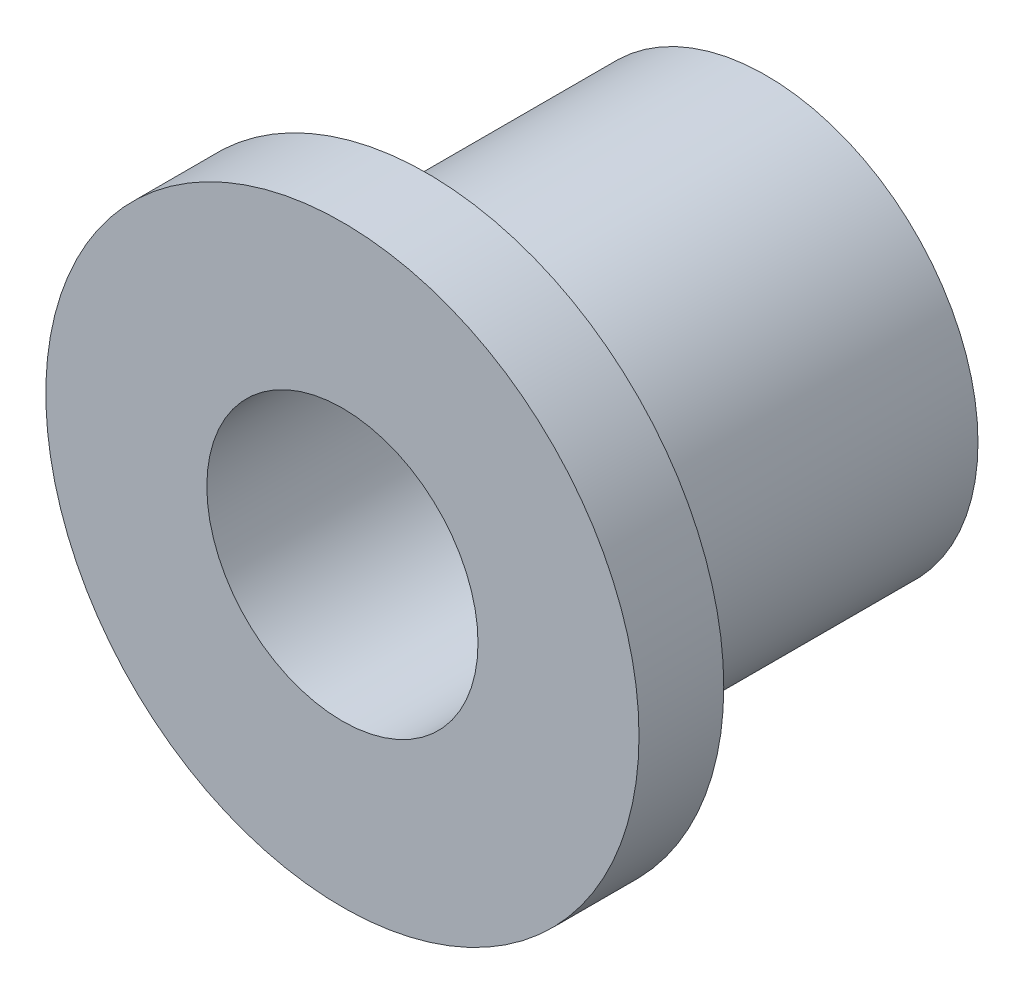
ISO-10303-21;
HEADER;
FILE_DESCRIPTION(('STEP AP214'),'2;1');
FILE_NAME('part.step','',(''),(''),'','','');
FILE_SCHEMA(('AUTOMOTIVE_DESIGN { 1 0 10303 214 1 1 1 1 }'));
ENDSEC;
DATA;
#1=APPLICATION_CONTEXT('core data for automotive mechanical design processes');
#2=APPLICATION_PROTOCOL_DEFINITION('international standard','automotive_design',2000,#1);
#3=PRODUCT_CONTEXT('',#1,'mechanical');
#4=PRODUCT('Part','Part','',(#3));
#5=PRODUCT_RELATED_PRODUCT_CATEGORY('part','',(#4));
#6=PRODUCT_DEFINITION_FORMATION('','',#4);
#7=PRODUCT_DEFINITION_CONTEXT('part definition',#1,'design');
#8=PRODUCT_DEFINITION('design','',#6,#7);
#9=PRODUCT_DEFINITION_SHAPE('','',#8);
#10=(LENGTH_UNIT() NAMED_UNIT(*) SI_UNIT(.MILLI.,.METRE.));
#11=(NAMED_UNIT(*) PLANE_ANGLE_UNIT() SI_UNIT($,.RADIAN.));
#12=(NAMED_UNIT(*) SI_UNIT($,.STERADIAN.) SOLID_ANGLE_UNIT());
#13=UNCERTAINTY_MEASURE_WITH_UNIT(LENGTH_MEASURE(1.E-05),#10,'distance_accuracy_value','');
#14=(GEOMETRIC_REPRESENTATION_CONTEXT(3) GLOBAL_UNCERTAINTY_ASSIGNED_CONTEXT((#13)) GLOBAL_UNIT_ASSIGNED_CONTEXT((#10,
#11,#12)) REPRESENTATION_CONTEXT('',''));
#15=CARTESIAN_POINT('',(0.,0.,0.));
#16=DIRECTION('',(0.,0.,1.));
#17=DIRECTION('',(1.,0.,0.));
#18=AXIS2_PLACEMENT_3D('',#15,#16,#17);
#19=CARTESIAN_POINT('',(0.,0.,0.));
#20=DIRECTION('',(0.,0.,1.));
#21=DIRECTION('',(1.,0.,0.));
#22=AXIS2_PLACEMENT_3D('',#19,#20,#21);
#23=PLANE('',#22);
#24=CARTESIAN_POINT('',(0.,0.,0.));
#25=DIRECTION('',(0.,0.,1.));
#26=DIRECTION('',(1.,0.,0.));
#27=AXIS2_PLACEMENT_3D('',#24,#25,#26);
#28=CIRCLE('',#27,2.5);
#29=CARTESIAN_POINT('',(2.5,0.,0.));
#30=VERTEX_POINT('',#29);
#31=EDGE_CURVE('E41',#30,#30,#28,.T.);
#32=ORIENTED_EDGE('',*,*,#31,.F.);
#33=EDGE_LOOP('',(#32));
#34=FACE_BOUND('',#33,.T.);
#35=CARTESIAN_POINT('',(0.,0.,0.));
#36=DIRECTION('',(0.,0.,1.));
#37=DIRECTION('',(1.,0.,0.));
#38=AXIS2_PLACEMENT_3D('',#35,#36,#37);
#39=CIRCLE('',#38,1.6);
#40=CARTESIAN_POINT('',(1.6,0.,0.));
#41=VERTEX_POINT('',#40);
#42=EDGE_CURVE('E50',#41,#41,#39,.T.);
#43=ORIENTED_EDGE('',*,*,#42,.T.);
#44=EDGE_LOOP('',(#43));
#45=FACE_BOUND('',#44,.T.);
#46=ADVANCED_FACE('F37',(#34,#45),#23,.F.);
#47=CARTESIAN_POINT('',(0.,0.,4.));
#48=DIRECTION('',(0.,0.,-1.));
#49=DIRECTION('',(-1.,0.,0.));
#50=AXIS2_PLACEMENT_3D('',#47,#48,#49);
#51=CYLINDRICAL_SURFACE('',#50,2.5);
#52=CARTESIAN_POINT('',(0.,0.,4.));
#53=DIRECTION('',(0.,0.,1.));
#54=DIRECTION('',(1.,0.,0.));
#55=AXIS2_PLACEMENT_3D('',#52,#53,#54);
#56=CIRCLE('',#55,2.5);
#57=CARTESIAN_POINT('',(2.5,0.,4.));
#58=VERTEX_POINT('',#57);
#59=EDGE_CURVE('E10',#58,#58,#56,.T.);
#60=ORIENTED_EDGE('',*,*,#59,.F.);
#61=EDGE_LOOP('',(#60));
#62=FACE_BOUND('',#61,.T.);
#63=ORIENTED_EDGE('',*,*,#31,.T.);
#64=EDGE_LOOP('',(#63));
#65=FACE_BOUND('',#64,.T.);
#66=ADVANCED_FACE('F39',(#62,#65),#51,.T.);
#67=CARTESIAN_POINT('',(0.,0.,4.));
#68=DIRECTION('',(0.,0.,-1.));
#69=DIRECTION('',(-1.,0.,0.));
#70=AXIS2_PLACEMENT_3D('',#67,#68,#69);
#71=CYLINDRICAL_SURFACE('',#70,1.6);
#72=ORIENTED_EDGE('',*,*,#42,.F.);
#73=EDGE_LOOP('',(#72));
#74=FACE_BOUND('',#73,.T.);
#75=CARTESIAN_POINT('',(0.,0.,5.));
#76=DIRECTION('',(0.,0.,1.));
#77=DIRECTION('',(1.,0.,0.));
#78=AXIS2_PLACEMENT_3D('',#75,#76,#77);
#79=CIRCLE('',#78,1.6);
#80=CARTESIAN_POINT('',(1.6,0.,5.));
#81=VERTEX_POINT('',#80);
#82=EDGE_CURVE('E60',#81,#81,#79,.T.);
#83=ORIENTED_EDGE('',*,*,#82,.T.);
#84=EDGE_LOOP('',(#83));
#85=FACE_BOUND('',#84,.T.);
#86=ADVANCED_FACE('F68',(#74,#85),#71,.F.);
#87=CARTESIAN_POINT('',(0.,0.,5.));
#88=DIRECTION('',(0.,0.,1.));
#89=DIRECTION('',(1.,0.,0.));
#90=AXIS2_PLACEMENT_3D('',#87,#88,#89);
#91=PLANE('',#90);
#92=CARTESIAN_POINT('',(0.,0.,5.));
#93=DIRECTION('',(0.,0.,1.));
#94=DIRECTION('',(1.,0.,0.));
#95=AXIS2_PLACEMENT_3D('',#92,#93,#94);
#96=CIRCLE('',#95,3.5);
#97=CARTESIAN_POINT('',(3.5,0.,5.));
#98=VERTEX_POINT('',#97);
#99=EDGE_CURVE('E55',#98,#98,#96,.T.);
#100=ORIENTED_EDGE('',*,*,#99,.T.);
#101=EDGE_LOOP('',(#100));
#102=FACE_BOUND('',#101,.T.);
#103=ORIENTED_EDGE('',*,*,#82,.F.);
#104=EDGE_LOOP('',(#103));
#105=FACE_BOUND('',#104,.T.);
#106=ADVANCED_FACE('F70',(#102,#105),#91,.T.);
#107=CARTESIAN_POINT('',(0.,0.,4.));
#108=DIRECTION('',(0.,0.,1.));
#109=DIRECTION('',(1.,0.,0.));
#110=AXIS2_PLACEMENT_3D('',#107,#108,#109);
#111=PLANE('',#110);
#112=ORIENTED_EDGE('',*,*,#59,.T.);
#113=EDGE_LOOP('',(#112));
#114=FACE_BOUND('',#113,.T.);
#115=CARTESIAN_POINT('',(0.,0.,4.));
#116=DIRECTION('',(0.,0.,1.));
#117=DIRECTION('',(1.,0.,0.));
#118=AXIS2_PLACEMENT_3D('',#115,#116,#117);
#119=CIRCLE('',#118,3.5);
#120=CARTESIAN_POINT('',(3.5,0.,4.));
#121=VERTEX_POINT('',#120);
#122=EDGE_CURVE('E56',#121,#121,#119,.T.);
#123=ORIENTED_EDGE('',*,*,#122,.F.);
#124=EDGE_LOOP('',(#123));
#125=FACE_BOUND('',#124,.T.);
#126=ADVANCED_FACE('F72',(#114,#125),#111,.F.);
#127=CARTESIAN_POINT('',(0.,0.,5.));
#128=DIRECTION('',(0.,0.,-1.));
#129=DIRECTION('',(-1.,0.,0.));
#130=AXIS2_PLACEMENT_3D('',#127,#128,#129);
#131=CYLINDRICAL_SURFACE('',#130,3.5);
#132=ORIENTED_EDGE('',*,*,#99,.F.);
#133=EDGE_LOOP('',(#132));
#134=FACE_BOUND('',#133,.T.);
#135=ORIENTED_EDGE('',*,*,#122,.T.);
#136=EDGE_LOOP('',(#135));
#137=FACE_BOUND('',#136,.T.);
#138=ADVANCED_FACE('F79',(#134,#137),#131,.T.);
#139=CLOSED_SHELL('',(#46,#66,#86,#106,#126,#138));
#140=MANIFOLD_SOLID_BREP('B2',#139);
#141=ADVANCED_BREP_SHAPE_REPRESENTATION('',(#18,#140),#14);
#142=SHAPE_DEFINITION_REPRESENTATION(#9,#141);
ENDSEC;
END-ISO-10303-21;
